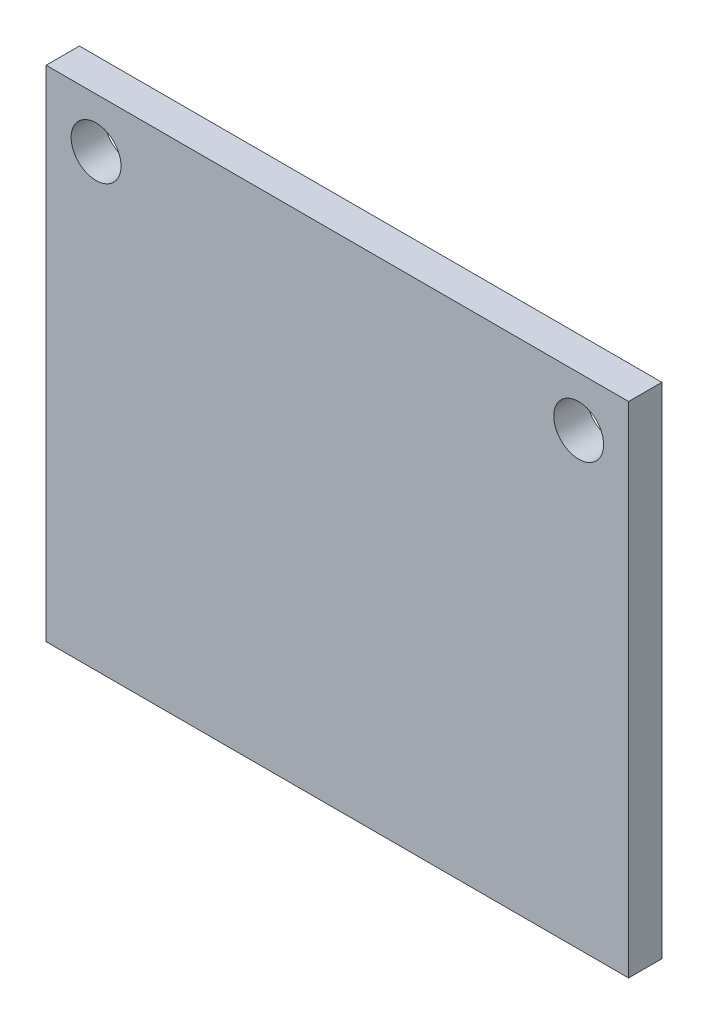
ISO-10303-21;
HEADER;
FILE_DESCRIPTION(('STEP AP214'),'2;1');
FILE_NAME('part.step','',(''),(''),'','','');
FILE_SCHEMA(('AUTOMOTIVE_DESIGN { 1 0 10303 214 1 1 1 1 }'));
ENDSEC;
DATA;
#1=APPLICATION_CONTEXT('core data for automotive mechanical design processes');
#2=APPLICATION_PROTOCOL_DEFINITION('international standard','automotive_design',2000,#1);
#3=PRODUCT_CONTEXT('',#1,'mechanical');
#4=PRODUCT('Part','Part','',(#3));
#5=PRODUCT_RELATED_PRODUCT_CATEGORY('part','',(#4));
#6=PRODUCT_DEFINITION_FORMATION('','',#4);
#7=PRODUCT_DEFINITION_CONTEXT('part definition',#1,'design');
#8=PRODUCT_DEFINITION('design','',#6,#7);
#9=PRODUCT_DEFINITION_SHAPE('','',#8);
#10=(LENGTH_UNIT() NAMED_UNIT(*) SI_UNIT(.MILLI.,.METRE.));
#11=(NAMED_UNIT(*) PLANE_ANGLE_UNIT() SI_UNIT($,.RADIAN.));
#12=(NAMED_UNIT(*) SI_UNIT($,.STERADIAN.) SOLID_ANGLE_UNIT());
#13=UNCERTAINTY_MEASURE_WITH_UNIT(LENGTH_MEASURE(1.E-05),#10,'distance_accuracy_value','');
#14=(GEOMETRIC_REPRESENTATION_CONTEXT(3) GLOBAL_UNCERTAINTY_ASSIGNED_CONTEXT((#13)) GLOBAL_UNIT_ASSIGNED_CONTEXT((#10,
#11,#12)) REPRESENTATION_CONTEXT('',''));
#15=CARTESIAN_POINT('',(0.,0.,0.));
#16=DIRECTION('',(0.,0.,1.));
#17=DIRECTION('',(1.,0.,0.));
#18=AXIS2_PLACEMENT_3D('',#15,#16,#17);
#19=CARTESIAN_POINT('',(-13.1996587030717,8.06313993174061,2.));
#20=DIRECTION('',(1.,0.,0.));
#21=DIRECTION('',(0.,1.,0.));
#22=AXIS2_PLACEMENT_3D('',#19,#20,#21);
#23=PLANE('',#22);
#24=DIRECTION('',(0.,-1.,0.));
#25=VECTOR('',#24,1.);
#26=CARTESIAN_POINT('',(-13.1996587030717,8.06313993174061,0.));
#27=LINE('',#26,#25);
#28=CARTESIAN_POINT('',(-13.1996587030717,8.06313993174061,0.));
#29=VERTEX_POINT('',#28);
#30=CARTESIAN_POINT('',(-13.1996587030717,-21.9368600682594,0.));
#31=VERTEX_POINT('',#30);
#32=EDGE_CURVE('E96',#29,#31,#27,.T.);
#33=ORIENTED_EDGE('',*,*,#32,.T.);
#34=DIRECTION('',(0.,0.,-1.));
#35=VECTOR('',#34,1.);
#36=CARTESIAN_POINT('',(-13.1996587030717,-21.9368600682594,2.));
#37=LINE('',#36,#35);
#38=CARTESIAN_POINT('',(-13.1996587030717,-21.9368600682594,2.));
#39=VERTEX_POINT('',#38);
#40=EDGE_CURVE('E11',#39,#31,#37,.T.);
#41=ORIENTED_EDGE('',*,*,#40,.F.);
#42=DIRECTION('',(0.,-1.,0.));
#43=VECTOR('',#42,1.);
#44=CARTESIAN_POINT('',(-13.1996587030717,8.06313993174061,2.));
#45=LINE('',#44,#43);
#46=CARTESIAN_POINT('',(-13.1996587030717,8.06313993174061,2.));
#47=VERTEX_POINT('',#46);
#48=EDGE_CURVE('E84',#47,#39,#45,.T.);
#49=ORIENTED_EDGE('',*,*,#48,.F.);
#50=DIRECTION('',(0.,0.,-1.));
#51=VECTOR('',#50,1.);
#52=CARTESIAN_POINT('',(-13.1996587030717,8.06313993174061,2.));
#53=LINE('',#52,#51);
#54=EDGE_CURVE('E92',#47,#29,#53,.T.);
#55=ORIENTED_EDGE('',*,*,#54,.T.);
#56=EDGE_LOOP('',(#33,#41,#49,#55));
#57=FACE_BOUND('',#56,.T.);
#58=ADVANCED_FACE('F33',(#57),#23,.F.);
#59=CARTESIAN_POINT('',(-13.1996587030717,-21.9368600682594,2.));
#60=DIRECTION('',(0.,1.,0.));
#61=DIRECTION('',(0.,0.,1.));
#62=AXIS2_PLACEMENT_3D('',#59,#60,#61);
#63=PLANE('',#62);
#64=DIRECTION('',(1.,0.,0.));
#65=VECTOR('',#64,1.);
#66=CARTESIAN_POINT('',(-13.1996587030717,-21.9368600682594,0.));
#67=LINE('',#66,#65);
#68=CARTESIAN_POINT('',(21.8003412969283,-21.9368600682594,0.));
#69=VERTEX_POINT('',#68);
#70=EDGE_CURVE('E88',#31,#69,#67,.T.);
#71=ORIENTED_EDGE('',*,*,#70,.T.);
#72=DIRECTION('',(0.,0.,-1.));
#73=VECTOR('',#72,1.);
#74=CARTESIAN_POINT('',(21.8003412969283,-21.9368600682594,2.));
#75=LINE('',#74,#73);
#76=CARTESIAN_POINT('',(21.8003412969283,-21.9368600682594,2.));
#77=VERTEX_POINT('',#76);
#78=EDGE_CURVE('E41',#77,#69,#75,.T.);
#79=ORIENTED_EDGE('',*,*,#78,.F.);
#80=DIRECTION('',(1.,0.,0.));
#81=VECTOR('',#80,1.);
#82=CARTESIAN_POINT('',(-13.1996587030717,-21.9368600682594,2.));
#83=LINE('',#82,#81);
#84=EDGE_CURVE('E79',#39,#77,#83,.T.);
#85=ORIENTED_EDGE('',*,*,#84,.F.);
#86=ORIENTED_EDGE('',*,*,#40,.T.);
#87=EDGE_LOOP('',(#71,#79,#85,#86));
#88=FACE_BOUND('',#87,.T.);
#89=ADVANCED_FACE('F87',(#88),#63,.F.);
#90=CARTESIAN_POINT('',(21.8003412969283,8.06313993174061,2.));
#91=DIRECTION('',(-1.,0.,0.));
#92=DIRECTION('',(0.,-1.,0.));
#93=AXIS2_PLACEMENT_3D('',#90,#91,#92);
#94=PLANE('',#93);
#95=DIRECTION('',(0.,1.,0.));
#96=VECTOR('',#95,1.);
#97=CARTESIAN_POINT('',(21.8003412969283,8.06313993174061,0.));
#98=LINE('',#97,#96);
#99=CARTESIAN_POINT('',(21.8003412969283,8.06313993174061,0.));
#100=VERTEX_POINT('',#99);
#101=EDGE_CURVE('E66',#69,#100,#98,.T.);
#102=ORIENTED_EDGE('',*,*,#101,.T.);
#103=DIRECTION('',(0.,0.,-1.));
#104=VECTOR('',#103,1.);
#105=CARTESIAN_POINT('',(21.8003412969283,8.06313993174061,2.));
#106=LINE('',#105,#104);
#107=CARTESIAN_POINT('',(21.8003412969283,8.06313993174061,2.));
#108=VERTEX_POINT('',#107);
#109=EDGE_CURVE('E89',#108,#100,#106,.T.);
#110=ORIENTED_EDGE('',*,*,#109,.F.);
#111=DIRECTION('',(0.,1.,0.));
#112=VECTOR('',#111,1.);
#113=CARTESIAN_POINT('',(21.8003412969283,8.06313993174061,2.));
#114=LINE('',#113,#112);
#115=EDGE_CURVE('E82',#77,#108,#114,.T.);
#116=ORIENTED_EDGE('',*,*,#115,.F.);
#117=ORIENTED_EDGE('',*,*,#78,.T.);
#118=EDGE_LOOP('',(#102,#110,#116,#117));
#119=FACE_BOUND('',#118,.T.);
#120=ADVANCED_FACE('F90',(#119),#94,.F.);
#121=CARTESIAN_POINT('',(-13.1996587030717,8.06313993174061,2.));
#122=DIRECTION('',(0.,-1.,0.));
#123=DIRECTION('',(0.,0.,-1.));
#124=AXIS2_PLACEMENT_3D('',#121,#122,#123);
#125=PLANE('',#124);
#126=DIRECTION('',(-1.,0.,0.));
#127=VECTOR('',#126,1.);
#128=CARTESIAN_POINT('',(-13.1996587030717,8.06313993174061,0.));
#129=LINE('',#128,#127);
#130=EDGE_CURVE('E72',#100,#29,#129,.T.);
#131=ORIENTED_EDGE('',*,*,#130,.T.);
#132=ORIENTED_EDGE('',*,*,#54,.F.);
#133=DIRECTION('',(-1.,0.,0.));
#134=VECTOR('',#133,1.);
#135=CARTESIAN_POINT('',(-13.1996587030717,8.06313993174061,2.));
#136=LINE('',#135,#134);
#137=EDGE_CURVE('E49',#108,#47,#136,.T.);
#138=ORIENTED_EDGE('',*,*,#137,.F.);
#139=ORIENTED_EDGE('',*,*,#109,.T.);
#140=EDGE_LOOP('',(#131,#132,#138,#139));
#141=FACE_BOUND('',#140,.T.);
#142=ADVANCED_FACE('F104',(#141),#125,.F.);
#143=CARTESIAN_POINT('',(0.,0.,2.));
#144=DIRECTION('',(0.,0.,1.));
#145=DIRECTION('',(1.,0.,0.));
#146=AXIS2_PLACEMENT_3D('',#143,#144,#145);
#147=PLANE('',#146);
#148=CARTESIAN_POINT('',(-10.1996587030717,5.06313993174061,2.));
#149=DIRECTION('',(0.,0.,1.));
#150=DIRECTION('',(1.,0.,0.));
#151=AXIS2_PLACEMENT_3D('',#148,#149,#150);
#152=CIRCLE('',#151,1.5);
#153=CARTESIAN_POINT('',(-8.69965870307166,5.06313993174061,2.));
#154=VERTEX_POINT('',#153);
#155=EDGE_CURVE('E116',#154,#154,#152,.T.);
#156=ORIENTED_EDGE('',*,*,#155,.F.);
#157=EDGE_LOOP('',(#156));
#158=FACE_BOUND('',#157,.T.);
#159=CARTESIAN_POINT('',(18.8003412969283,5.06313993174061,2.));
#160=DIRECTION('',(0.,0.,1.));
#161=DIRECTION('',(1.,0.,0.));
#162=AXIS2_PLACEMENT_3D('',#159,#160,#161);
#163=CIRCLE('',#162,1.5);
#164=CARTESIAN_POINT('',(20.3003412969283,5.06313993174061,2.));
#165=VERTEX_POINT('',#164);
#166=EDGE_CURVE('E110',#165,#165,#163,.T.);
#167=ORIENTED_EDGE('',*,*,#166,.F.);
#168=EDGE_LOOP('',(#167));
#169=FACE_BOUND('',#168,.T.);
#170=ORIENTED_EDGE('',*,*,#48,.T.);
#171=ORIENTED_EDGE('',*,*,#84,.T.);
#172=ORIENTED_EDGE('',*,*,#115,.T.);
#173=ORIENTED_EDGE('',*,*,#137,.T.);
#174=EDGE_LOOP('',(#170,#171,#172,#173));
#175=FACE_BOUND('',#174,.T.);
#176=ADVANCED_FACE('F80',(#158,#169,#175),#147,.T.);
#177=CARTESIAN_POINT('',(0.,0.,0.));
#178=DIRECTION('',(0.,0.,1.));
#179=DIRECTION('',(1.,0.,0.));
#180=AXIS2_PLACEMENT_3D('',#177,#178,#179);
#181=PLANE('',#180);
#182=CARTESIAN_POINT('',(-10.1996587030717,5.06313993174061,0.));
#183=DIRECTION('',(0.,0.,1.));
#184=DIRECTION('',(1.,0.,0.));
#185=AXIS2_PLACEMENT_3D('',#182,#183,#184);
#186=CIRCLE('',#185,1.5);
#187=CARTESIAN_POINT('',(-8.69965870307166,5.06313993174061,0.));
#188=VERTEX_POINT('',#187);
#189=EDGE_CURVE('E99',#188,#188,#186,.T.);
#190=ORIENTED_EDGE('',*,*,#189,.T.);
#191=EDGE_LOOP('',(#190));
#192=FACE_BOUND('',#191,.T.);
#193=CARTESIAN_POINT('',(18.8003412969283,5.06313993174061,0.));
#194=DIRECTION('',(0.,0.,1.));
#195=DIRECTION('',(1.,0.,0.));
#196=AXIS2_PLACEMENT_3D('',#193,#194,#195);
#197=CIRCLE('',#196,1.5);
#198=CARTESIAN_POINT('',(20.3003412969283,5.06313993174061,0.));
#199=VERTEX_POINT('',#198);
#200=EDGE_CURVE('E113',#199,#199,#197,.T.);
#201=ORIENTED_EDGE('',*,*,#200,.T.);
#202=EDGE_LOOP('',(#201));
#203=FACE_BOUND('',#202,.T.);
#204=ORIENTED_EDGE('',*,*,#32,.F.);
#205=ORIENTED_EDGE('',*,*,#130,.F.);
#206=ORIENTED_EDGE('',*,*,#101,.F.);
#207=ORIENTED_EDGE('',*,*,#70,.F.);
#208=EDGE_LOOP('',(#204,#205,#206,#207));
#209=FACE_BOUND('',#208,.T.);
#210=ADVANCED_FACE('F107',(#192,#203,#209),#181,.F.);
#211=CARTESIAN_POINT('',(18.8003412969283,5.06313993174061,0.));
#212=DIRECTION('',(0.,0.,1.));
#213=DIRECTION('',(1.,0.,0.));
#214=AXIS2_PLACEMENT_3D('',#211,#212,#213);
#215=CYLINDRICAL_SURFACE('',#214,1.5);
#216=ORIENTED_EDGE('',*,*,#200,.F.);
#217=EDGE_LOOP('',(#216));
#218=FACE_BOUND('',#217,.T.);
#219=ORIENTED_EDGE('',*,*,#166,.T.);
#220=EDGE_LOOP('',(#219));
#221=FACE_BOUND('',#220,.T.);
#222=ADVANCED_FACE('F127',(#218,#221),#215,.F.);
#223=CARTESIAN_POINT('',(-10.1996587030717,5.06313993174061,0.));
#224=DIRECTION('',(0.,0.,1.));
#225=DIRECTION('',(1.,0.,0.));
#226=AXIS2_PLACEMENT_3D('',#223,#224,#225);
#227=CYLINDRICAL_SURFACE('',#226,1.5);
#228=ORIENTED_EDGE('',*,*,#189,.F.);
#229=EDGE_LOOP('',(#228));
#230=FACE_BOUND('',#229,.T.);
#231=ORIENTED_EDGE('',*,*,#155,.T.);
#232=EDGE_LOOP('',(#231));
#233=FACE_BOUND('',#232,.T.);
#234=ADVANCED_FACE('F124',(#230,#233),#227,.F.);
#235=CLOSED_SHELL('',(#58,#89,#120,#142,#176,#210,#222,#234));
#236=MANIFOLD_SOLID_BREP('B2',#235);
#237=ADVANCED_BREP_SHAPE_REPRESENTATION('',(#18,#236),#14);
#238=SHAPE_DEFINITION_REPRESENTATION(#9,#237);
ENDSEC;
END-ISO-10303-21;
